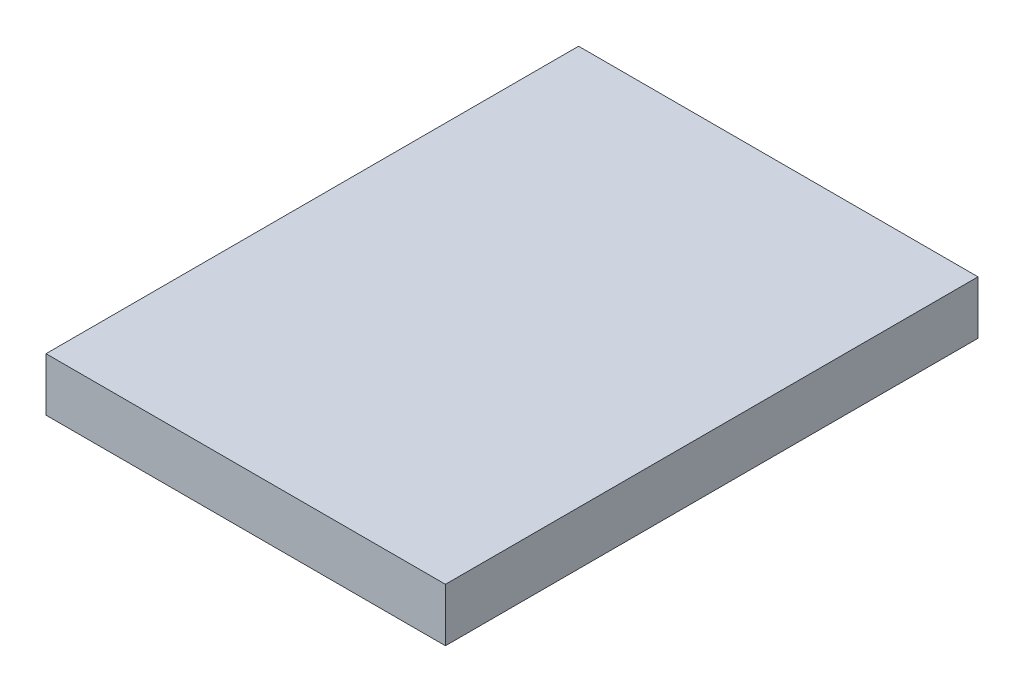
ISO-10303-21;
HEADER;
FILE_DESCRIPTION(('STEP AP214'),'2;1');
FILE_NAME('part.step','',(''),(''),'','','');
FILE_SCHEMA(('AUTOMOTIVE_DESIGN { 1 0 10303 214 1 1 1 1 }'));
ENDSEC;
DATA;
#1=APPLICATION_CONTEXT('core data for automotive mechanical design processes');
#2=APPLICATION_PROTOCOL_DEFINITION('international standard','automotive_design',2000,#1);
#3=PRODUCT_CONTEXT('',#1,'mechanical');
#4=PRODUCT('Part','Part','',(#3));
#5=PRODUCT_RELATED_PRODUCT_CATEGORY('part','',(#4));
#6=PRODUCT_DEFINITION_FORMATION('','',#4);
#7=PRODUCT_DEFINITION_CONTEXT('part definition',#1,'design');
#8=PRODUCT_DEFINITION('design','',#6,#7);
#9=PRODUCT_DEFINITION_SHAPE('','',#8);
#10=(LENGTH_UNIT() NAMED_UNIT(*) SI_UNIT(.MILLI.,.METRE.));
#11=(NAMED_UNIT(*) PLANE_ANGLE_UNIT() SI_UNIT($,.RADIAN.));
#12=(NAMED_UNIT(*) SI_UNIT($,.STERADIAN.) SOLID_ANGLE_UNIT());
#13=UNCERTAINTY_MEASURE_WITH_UNIT(LENGTH_MEASURE(1.E-05),#10,'distance_accuracy_value','');
#14=(GEOMETRIC_REPRESENTATION_CONTEXT(3) GLOBAL_UNCERTAINTY_ASSIGNED_CONTEXT((#13)) GLOBAL_UNIT_ASSIGNED_CONTEXT((#10,
#11,#12)) REPRESENTATION_CONTEXT('',''));
#15=CARTESIAN_POINT('',(0.,0.,0.));
#16=DIRECTION('',(0.,0.,1.));
#17=DIRECTION('',(1.,0.,0.));
#18=AXIS2_PLACEMENT_3D('',#15,#16,#17);
#19=CARTESIAN_POINT('',(-204.029085471643,20.,29.0253332948636));
#20=DIRECTION('',(-1.,0.,0.));
#21=DIRECTION('',(0.,0.,1.));
#22=AXIS2_PLACEMENT_3D('',#19,#20,#21);
#23=PLANE('',#22);
#24=DIRECTION('',(0.,0.,1.));
#25=VECTOR('',#24,1.);
#26=CARTESIAN_POINT('',(-204.029085471643,0.,29.0253332948636));
#27=LINE('',#26,#25);
#28=CARTESIAN_POINT('',(-204.029085471643,0.,-170.974666705136));
#29=VERTEX_POINT('',#28);
#30=CARTESIAN_POINT('',(-204.029085471643,0.,29.0253332948636));
#31=VERTEX_POINT('',#30);
#32=EDGE_CURVE('E47',#29,#31,#27,.T.);
#33=ORIENTED_EDGE('',*,*,#32,.F.);
#34=DIRECTION('',(0.,-1.,0.));
#35=VECTOR('',#34,1.);
#36=CARTESIAN_POINT('',(-204.029085471643,20.,-170.974666705136));
#37=LINE('',#36,#35);
#38=CARTESIAN_POINT('',(-204.029085471643,-20.,-170.974666705136));
#39=VERTEX_POINT('',#38);
#40=EDGE_CURVE('E75',#29,#39,#37,.T.);
#41=ORIENTED_EDGE('',*,*,#40,.T.);
#42=DIRECTION('',(0.,0.,-1.));
#43=VECTOR('',#42,1.);
#44=CARTESIAN_POINT('',(-204.029085471643,-20.,29.0253332948636));
#45=LINE('',#44,#43);
#46=CARTESIAN_POINT('',(-204.029085471643,-20.,29.0253332948636));
#47=VERTEX_POINT('',#46);
#48=EDGE_CURVE('E79',#47,#39,#45,.T.);
#49=ORIENTED_EDGE('',*,*,#48,.F.);
#50=DIRECTION('',(0.,-1.,0.));
#51=VECTOR('',#50,1.);
#52=CARTESIAN_POINT('',(-204.029085471643,20.,29.0253332948636));
#53=LINE('',#52,#51);
#54=EDGE_CURVE('E102',#31,#47,#53,.T.);
#55=ORIENTED_EDGE('',*,*,#54,.F.);
#56=EDGE_LOOP('',(#33,#41,#49,#55));
#57=FACE_BOUND('',#56,.T.);
#58=ADVANCED_FACE('F39',(#57),#23,.T.);
#59=CARTESIAN_POINT('',(-54.029085471643,20.,29.0253332948636));
#60=DIRECTION('',(0.,0.,1.));
#61=DIRECTION('',(1.,0.,0.));
#62=AXIS2_PLACEMENT_3D('',#59,#60,#61);
#63=PLANE('',#62);
#64=DIRECTION('',(1.,0.,0.));
#65=VECTOR('',#64,1.);
#66=CARTESIAN_POINT('',(-54.029085471643,0.,29.0253332948636));
#67=LINE('',#66,#65);
#68=CARTESIAN_POINT('',(-54.029085471643,0.,29.0253332948636));
#69=VERTEX_POINT('',#68);
#70=EDGE_CURVE('E54',#31,#69,#67,.T.);
#71=ORIENTED_EDGE('',*,*,#70,.F.);
#72=ORIENTED_EDGE('',*,*,#54,.T.);
#73=DIRECTION('',(-1.,0.,0.));
#74=VECTOR('',#73,1.);
#75=CARTESIAN_POINT('',(-54.029085471643,-20.,29.0253332948636));
#76=LINE('',#75,#74);
#77=CARTESIAN_POINT('',(-54.029085471643,-20.,29.0253332948636));
#78=VERTEX_POINT('',#77);
#79=EDGE_CURVE('E84',#78,#47,#76,.T.);
#80=ORIENTED_EDGE('',*,*,#79,.F.);
#81=DIRECTION('',(0.,-1.,0.));
#82=VECTOR('',#81,1.);
#83=CARTESIAN_POINT('',(-54.029085471643,20.,29.0253332948636));
#84=LINE('',#83,#82);
#85=EDGE_CURVE('E105',#69,#78,#84,.T.);
#86=ORIENTED_EDGE('',*,*,#85,.F.);
#87=EDGE_LOOP('',(#71,#72,#80,#86));
#88=FACE_BOUND('',#87,.T.);
#89=ADVANCED_FACE('F111',(#88),#63,.T.);
#90=CARTESIAN_POINT('',(-54.029085471643,20.,29.0253332948636));
#91=DIRECTION('',(1.,0.,0.));
#92=DIRECTION('',(0.,0.,-1.));
#93=AXIS2_PLACEMENT_3D('',#90,#91,#92);
#94=PLANE('',#93);
#95=DIRECTION('',(0.,0.,-1.));
#96=VECTOR('',#95,1.);
#97=CARTESIAN_POINT('',(-54.029085471643,0.,29.0253332948636));
#98=LINE('',#97,#96);
#99=CARTESIAN_POINT('',(-54.029085471643,0.,-170.974666705136));
#100=VERTEX_POINT('',#99);
#101=EDGE_CURVE('E104',#69,#100,#98,.T.);
#102=ORIENTED_EDGE('',*,*,#101,.F.);
#103=ORIENTED_EDGE('',*,*,#85,.T.);
#104=DIRECTION('',(0.,0.,1.));
#105=VECTOR('',#104,1.);
#106=CARTESIAN_POINT('',(-54.029085471643,-20.,29.0253332948636));
#107=LINE('',#106,#105);
#108=CARTESIAN_POINT('',(-54.029085471643,-20.,-170.974666705136));
#109=VERTEX_POINT('',#108);
#110=EDGE_CURVE('E92',#109,#78,#107,.T.);
#111=ORIENTED_EDGE('',*,*,#110,.F.);
#112=DIRECTION('',(0.,-1.,0.));
#113=VECTOR('',#112,1.);
#114=CARTESIAN_POINT('',(-54.029085471643,20.,-170.974666705136));
#115=LINE('',#114,#113);
#116=EDGE_CURVE('E83',#100,#109,#115,.T.);
#117=ORIENTED_EDGE('',*,*,#116,.F.);
#118=EDGE_LOOP('',(#102,#103,#111,#117));
#119=FACE_BOUND('',#118,.T.);
#120=ADVANCED_FACE('F109',(#119),#94,.T.);
#121=CARTESIAN_POINT('',(-54.029085471643,20.,-170.974666705136));
#122=DIRECTION('',(0.,0.,-1.));
#123=DIRECTION('',(-1.,0.,0.));
#124=AXIS2_PLACEMENT_3D('',#121,#122,#123);
#125=PLANE('',#124);
#126=DIRECTION('',(-1.,0.,0.));
#127=VECTOR('',#126,1.);
#128=CARTESIAN_POINT('',(-54.029085471643,0.,-170.974666705136));
#129=LINE('',#128,#127);
#130=EDGE_CURVE('E11',#100,#29,#129,.T.);
#131=ORIENTED_EDGE('',*,*,#130,.F.);
#132=ORIENTED_EDGE('',*,*,#116,.T.);
#133=DIRECTION('',(1.,0.,0.));
#134=VECTOR('',#133,1.);
#135=CARTESIAN_POINT('',(-54.029085471643,-20.,-170.974666705136));
#136=LINE('',#135,#134);
#137=EDGE_CURVE('E86',#39,#109,#136,.T.);
#138=ORIENTED_EDGE('',*,*,#137,.F.);
#139=ORIENTED_EDGE('',*,*,#40,.F.);
#140=EDGE_LOOP('',(#131,#132,#138,#139));
#141=FACE_BOUND('',#140,.T.);
#142=ADVANCED_FACE('F87',(#141),#125,.T.);
#143=CARTESIAN_POINT('',(0.,-20.,0.));
#144=DIRECTION('',(0.,1.,0.));
#145=DIRECTION('',(0.,0.,1.));
#146=AXIS2_PLACEMENT_3D('',#143,#144,#145);
#147=PLANE('',#146);
#148=ORIENTED_EDGE('',*,*,#48,.T.);
#149=ORIENTED_EDGE('',*,*,#137,.T.);
#150=ORIENTED_EDGE('',*,*,#110,.T.);
#151=ORIENTED_EDGE('',*,*,#79,.T.);
#152=EDGE_LOOP('',(#148,#149,#150,#151));
#153=FACE_BOUND('',#152,.T.);
#154=ADVANCED_FACE('F94',(#153),#147,.F.);
#155=CARTESIAN_POINT('',(0.,0.,0.));
#156=DIRECTION('',(0.,-1.,0.));
#157=DIRECTION('',(0.,0.,-1.));
#158=AXIS2_PLACEMENT_3D('',#155,#156,#157);
#159=PLANE('',#158);
#160=ORIENTED_EDGE('',*,*,#32,.T.);
#161=ORIENTED_EDGE('',*,*,#70,.T.);
#162=ORIENTED_EDGE('',*,*,#101,.T.);
#163=ORIENTED_EDGE('',*,*,#130,.T.);
#164=EDGE_LOOP('',(#160,#161,#162,#163));
#165=FACE_BOUND('',#164,.T.);
#166=ADVANCED_FACE('F113',(#165),#159,.F.);
#167=CLOSED_SHELL('',(#58,#89,#120,#142,#154,#166));
#168=MANIFOLD_SOLID_BREP('B2',#167);
#169=ADVANCED_BREP_SHAPE_REPRESENTATION('',(#18,#168),#14);
#170=SHAPE_DEFINITION_REPRESENTATION(#9,#169);
ENDSEC;
END-ISO-10303-21;
